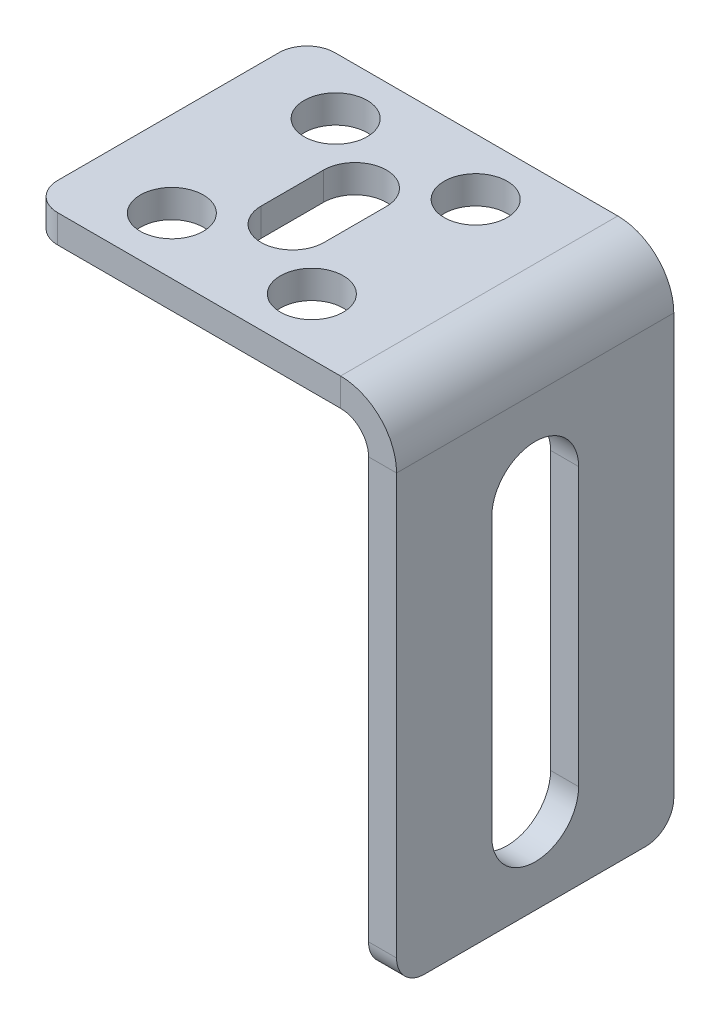
ISO-10303-21;
HEADER;
FILE_DESCRIPTION(('STEP AP214'),'2;1');
FILE_NAME('part.step','',(''),(''),'','','');
FILE_SCHEMA(('AUTOMOTIVE_DESIGN { 1 0 10303 214 1 1 1 1 }'));
ENDSEC;
DATA;
#1=APPLICATION_CONTEXT('core data for automotive mechanical design processes');
#2=APPLICATION_PROTOCOL_DEFINITION('international standard','automotive_design',2000,#1);
#3=PRODUCT_CONTEXT('',#1,'mechanical');
#4=PRODUCT('Part','Part','',(#3));
#5=PRODUCT_RELATED_PRODUCT_CATEGORY('part','',(#4));
#6=PRODUCT_DEFINITION_FORMATION('','',#4);
#7=PRODUCT_DEFINITION_CONTEXT('part definition',#1,'design');
#8=PRODUCT_DEFINITION('design','',#6,#7);
#9=PRODUCT_DEFINITION_SHAPE('','',#8);
#10=(LENGTH_UNIT() NAMED_UNIT(*) SI_UNIT(.MILLI.,.METRE.));
#11=(NAMED_UNIT(*) PLANE_ANGLE_UNIT() SI_UNIT($,.RADIAN.));
#12=(NAMED_UNIT(*) SI_UNIT($,.STERADIAN.) SOLID_ANGLE_UNIT());
#13=UNCERTAINTY_MEASURE_WITH_UNIT(LENGTH_MEASURE(1.E-05),#10,'distance_accuracy_value','');
#14=(GEOMETRIC_REPRESENTATION_CONTEXT(3) GLOBAL_UNCERTAINTY_ASSIGNED_CONTEXT((#13)) GLOBAL_UNIT_ASSIGNED_CONTEXT((#10,
#11,#12)) REPRESENTATION_CONTEXT('',''));
#15=CARTESIAN_POINT('',(0.,0.,0.));
#16=DIRECTION('',(0.,0.,1.));
#17=DIRECTION('',(1.,0.,0.));
#18=AXIS2_PLACEMENT_3D('',#15,#16,#17);
#19=CARTESIAN_POINT('',(-15.1,-36.001,12.1277472107018));
#20=DIRECTION('',(0.,1.,0.));
#21=DIRECTION('',(-1.,0.,0.));
#22=AXIS2_PLACEMENT_3D('',#19,#20,#21);
#23=CYLINDRICAL_SURFACE('',#22,2.25);
#24=CARTESIAN_POINT('',(-15.1,0.,12.1277472107018));
#25=DIRECTION('',(0.,1.,0.));
#26=DIRECTION('',(-1.,0.,0.));
#27=AXIS2_PLACEMENT_3D('',#24,#25,#26);
#28=CIRCLE('',#27,2.25);
#29=CARTESIAN_POINT('',(-17.35,0.,12.1277472107018));
#30=VERTEX_POINT('',#29);
#31=CARTESIAN_POINT('',(-12.85,0.,12.1277472107018));
#32=VERTEX_POINT('',#31);
#33=EDGE_CURVE('E165',#30,#32,#28,.T.);
#34=ORIENTED_EDGE('',*,*,#33,.T.);
#35=DIRECTION('',(0.,-1.,0.));
#36=VECTOR('',#35,1.);
#37=CARTESIAN_POINT('',(-12.85,0.,12.1277472107018));
#38=LINE('',#37,#36);
#39=CARTESIAN_POINT('',(-12.85,-2.,12.1277472107018));
#40=VERTEX_POINT('',#39);
#41=EDGE_CURVE('E621',#32,#40,#38,.T.);
#42=ORIENTED_EDGE('',*,*,#41,.T.);
#43=CARTESIAN_POINT('',(-15.1,-2.,12.1277472107018));
#44=DIRECTION('',(0.,-1.,0.));
#45=DIRECTION('',(1.,0.,0.));
#46=AXIS2_PLACEMENT_3D('',#43,#44,#45);
#47=CIRCLE('',#46,2.25);
#48=CARTESIAN_POINT('',(-17.35,-2.,12.1277472107018));
#49=VERTEX_POINT('',#48);
#50=EDGE_CURVE('E167',#49,#40,#47,.F.);
#51=ORIENTED_EDGE('',*,*,#50,.F.);
#52=DIRECTION('',(0.,-1.,0.));
#53=VECTOR('',#52,1.);
#54=CARTESIAN_POINT('',(-17.35,0.,12.1277472107018));
#55=LINE('',#54,#53);
#56=EDGE_CURVE('E153',#30,#49,#55,.T.);
#57=ORIENTED_EDGE('',*,*,#56,.F.);
#58=EDGE_LOOP('',(#34,#42,#51,#57));
#59=FACE_BOUND('',#58,.T.);
#60=ADVANCED_FACE('F16',(#59),#23,.F.);
#61=CARTESIAN_POINT('',(-15.1,-36.001,7.67225278929825));
#62=DIRECTION('',(0.,1.,0.));
#63=DIRECTION('',(-1.,0.,0.));
#64=AXIS2_PLACEMENT_3D('',#61,#62,#63);
#65=CYLINDRICAL_SURFACE('',#64,2.25);
#66=CARTESIAN_POINT('',(-15.1,-2.,7.67225278929825));
#67=DIRECTION('',(0.,-1.,0.));
#68=DIRECTION('',(1.,0.,0.));
#69=AXIS2_PLACEMENT_3D('',#66,#67,#68);
#70=CIRCLE('',#69,2.25);
#71=CARTESIAN_POINT('',(-17.35,-2.,7.67225278929824));
#72=VERTEX_POINT('',#71);
#73=CARTESIAN_POINT('',(-12.85,-2.,7.67225278929825));
#74=VERTEX_POINT('',#73);
#75=EDGE_CURVE('E629',#72,#74,#70,.T.);
#76=ORIENTED_EDGE('',*,*,#75,.T.);
#77=DIRECTION('',(0.,-1.,0.));
#78=VECTOR('',#77,1.);
#79=CARTESIAN_POINT('',(-12.85,0.,7.67225278929825));
#80=LINE('',#79,#78);
#81=CARTESIAN_POINT('',(-12.85,0.,7.67225278929825));
#82=VERTEX_POINT('',#81);
#83=EDGE_CURVE('E622',#82,#74,#80,.T.);
#84=ORIENTED_EDGE('',*,*,#83,.F.);
#85=CARTESIAN_POINT('',(-15.1,0.,7.67225278929825));
#86=DIRECTION('',(0.,-1.,0.));
#87=DIRECTION('',(-1.,0.,0.));
#88=AXIS2_PLACEMENT_3D('',#85,#86,#87);
#89=CIRCLE('',#88,2.25);
#90=CARTESIAN_POINT('',(-17.35,0.,7.67225278929824));
#91=VERTEX_POINT('',#90);
#92=EDGE_CURVE('E642',#91,#82,#89,.T.);
#93=ORIENTED_EDGE('',*,*,#92,.F.);
#94=DIRECTION('',(0.,-1.,0.));
#95=VECTOR('',#94,1.);
#96=CARTESIAN_POINT('',(-17.35,0.,7.67225278929824));
#97=LINE('',#96,#95);
#98=EDGE_CURVE('E154',#91,#72,#97,.T.);
#99=ORIENTED_EDGE('',*,*,#98,.T.);
#100=EDGE_LOOP('',(#76,#84,#93,#99));
#101=FACE_BOUND('',#100,.T.);
#102=ADVANCED_FACE('F352',(#101),#65,.F.);
#103=CARTESIAN_POINT('',(-2.,0.,0.));
#104=DIRECTION('',(0.,0.,1.));
#105=DIRECTION('',(0.,1.,0.));
#106=AXIS2_PLACEMENT_3D('',#103,#104,#105);
#107=PLANE('',#106);
#108=DIRECTION('',(0.,-1.,0.));
#109=VECTOR('',#108,1.);
#110=CARTESIAN_POINT('',(0.,0.,0.));
#111=LINE('',#110,#109);
#112=CARTESIAN_POINT('',(0.,-34.,0.));
#113=VERTEX_POINT('',#112);
#114=CARTESIAN_POINT('',(0.,-4.,0.));
#115=VERTEX_POINT('',#114);
#116=EDGE_CURVE('E237',#113,#115,#111,.F.);
#117=ORIENTED_EDGE('',*,*,#116,.F.);
#118=DIRECTION('',(1.,0.,0.));
#119=VECTOR('',#118,1.);
#120=CARTESIAN_POINT('',(-2.,-34.,0.));
#121=LINE('',#120,#119);
#122=CARTESIAN_POINT('',(-2.,-34.,0.));
#123=VERTEX_POINT('',#122);
#124=EDGE_CURVE('E251',#113,#123,#121,.F.);
#125=ORIENTED_EDGE('',*,*,#124,.T.);
#126=DIRECTION('',(0.,1.,0.));
#127=VECTOR('',#126,1.);
#128=CARTESIAN_POINT('',(-2.,0.,0.));
#129=LINE('',#128,#127);
#130=CARTESIAN_POINT('',(-2.,-4.,0.));
#131=VERTEX_POINT('',#130);
#132=EDGE_CURVE('E189',#123,#131,#129,.T.);
#133=ORIENTED_EDGE('',*,*,#132,.T.);
#134=DIRECTION('',(-1.,0.,0.));
#135=VECTOR('',#134,1.);
#136=CARTESIAN_POINT('',(-2.,-4.,0.));
#137=LINE('',#136,#135);
#138=EDGE_CURVE('E248',#115,#131,#137,.T.);
#139=ORIENTED_EDGE('',*,*,#138,.F.);
#140=EDGE_LOOP('',(#117,#125,#133,#139));
#141=FACE_BOUND('',#140,.T.);
#142=ADVANCED_FACE('F350',(#141),#107,.F.);
#143=CARTESIAN_POINT('',(-2.,-36.,64.3245999420545));
#144=DIRECTION('',(0.,1.,0.));
#145=DIRECTION('',(0.,0.,-1.));
#146=AXIS2_PLACEMENT_3D('',#143,#144,#145);
#147=PLANE('',#146);
#148=DIRECTION('',(0.,0.,-1.));
#149=VECTOR('',#148,1.);
#150=CARTESIAN_POINT('',(-2.,-36.,64.3245999420545));
#151=LINE('',#150,#149);
#152=CARTESIAN_POINT('',(-2.,-36.,17.8));
#153=VERTEX_POINT('',#152);
#154=CARTESIAN_POINT('',(-2.,-36.,2.));
#155=VERTEX_POINT('',#154);
#156=EDGE_CURVE('E192',#153,#155,#151,.T.);
#157=ORIENTED_EDGE('',*,*,#156,.T.);
#158=DIRECTION('',(1.,0.,0.));
#159=VECTOR('',#158,1.);
#160=CARTESIAN_POINT('',(-2.,-36.,2.));
#161=LINE('',#160,#159);
#162=CARTESIAN_POINT('',(0.,-36.,2.));
#163=VERTEX_POINT('',#162);
#164=EDGE_CURVE('E262',#155,#163,#161,.T.);
#165=ORIENTED_EDGE('',*,*,#164,.T.);
#166=DIRECTION('',(0.,0.,1.));
#167=VECTOR('',#166,1.);
#168=CARTESIAN_POINT('',(0.,-36.,64.3245999420545));
#169=LINE('',#168,#167);
#170=CARTESIAN_POINT('',(0.,-36.,17.8));
#171=VERTEX_POINT('',#170);
#172=EDGE_CURVE('E229',#171,#163,#169,.F.);
#173=ORIENTED_EDGE('',*,*,#172,.F.);
#174=DIRECTION('',(1.,0.,0.));
#175=VECTOR('',#174,1.);
#176=CARTESIAN_POINT('',(-2.,-36.,17.8));
#177=LINE('',#176,#175);
#178=EDGE_CURVE('E259',#171,#153,#177,.F.);
#179=ORIENTED_EDGE('',*,*,#178,.T.);
#180=EDGE_LOOP('',(#157,#165,#173,#179));
#181=FACE_BOUND('',#180,.T.);
#182=ADVANCED_FACE('F342',(#181),#147,.F.);
#183=CARTESIAN_POINT('',(-2.,0.,19.8));
#184=DIRECTION('',(0.,0.,-1.));
#185=DIRECTION('',(0.,-1.,0.));
#186=AXIS2_PLACEMENT_3D('',#183,#184,#185);
#187=PLANE('',#186);
#188=DIRECTION('',(0.,-1.,0.));
#189=VECTOR('',#188,1.);
#190=CARTESIAN_POINT('',(-2.,0.,19.8));
#191=LINE('',#190,#189);
#192=CARTESIAN_POINT('',(-2.,-4.,19.8));
#193=VERTEX_POINT('',#192);
#194=CARTESIAN_POINT('',(-2.,-34.,19.8));
#195=VERTEX_POINT('',#194);
#196=EDGE_CURVE('E186',#193,#195,#191,.T.);
#197=ORIENTED_EDGE('',*,*,#196,.T.);
#198=DIRECTION('',(1.,0.,0.));
#199=VECTOR('',#198,1.);
#200=CARTESIAN_POINT('',(-2.,-34.,19.8));
#201=LINE('',#200,#199);
#202=CARTESIAN_POINT('',(0.,-34.,19.8));
#203=VERTEX_POINT('',#202);
#204=EDGE_CURVE('E268',#195,#203,#201,.T.);
#205=ORIENTED_EDGE('',*,*,#204,.T.);
#206=DIRECTION('',(0.,-1.,0.));
#207=VECTOR('',#206,1.);
#208=CARTESIAN_POINT('',(0.,0.,19.8));
#209=LINE('',#208,#207);
#210=CARTESIAN_POINT('',(0.,-4.,19.8));
#211=VERTEX_POINT('',#210);
#212=EDGE_CURVE('E233',#211,#203,#209,.T.);
#213=ORIENTED_EDGE('',*,*,#212,.F.);
#214=DIRECTION('',(-1.,0.,0.));
#215=VECTOR('',#214,1.);
#216=CARTESIAN_POINT('',(-2.,-4.,19.8));
#217=LINE('',#216,#215);
#218=EDGE_CURVE('E246',#211,#193,#217,.T.);
#219=ORIENTED_EDGE('',*,*,#218,.T.);
#220=EDGE_LOOP('',(#197,#205,#213,#219));
#221=FACE_BOUND('',#220,.T.);
#222=ADVANCED_FACE('F333',(#221),#187,.F.);
#223=CARTESIAN_POINT('',(-4.,-4.,19.8));
#224=DIRECTION('',(0.,0.,1.));
#225=DIRECTION('',(1.,0.,0.));
#226=AXIS2_PLACEMENT_3D('',#223,#224,#225);
#227=PLANE('',#226);
#228=ORIENTED_EDGE('',*,*,#218,.F.);
#229=CARTESIAN_POINT('',(-4.,-4.,19.8));
#230=DIRECTION('',(0.,0.,1.));
#231=DIRECTION('',(1.,0.,0.));
#232=AXIS2_PLACEMENT_3D('',#229,#230,#231);
#233=CIRCLE('',#232,4.);
#234=CARTESIAN_POINT('',(-4.,0.,19.8));
#235=VERTEX_POINT('',#234);
#236=EDGE_CURVE('E230',#211,#235,#233,.T.);
#237=ORIENTED_EDGE('',*,*,#236,.T.);
#238=DIRECTION('',(0.,-1.,0.));
#239=VECTOR('',#238,1.);
#240=CARTESIAN_POINT('',(-4.,-2.,19.8));
#241=LINE('',#240,#239);
#242=CARTESIAN_POINT('',(-4.,-2.,19.8));
#243=VERTEX_POINT('',#242);
#244=EDGE_CURVE('E243',#235,#243,#241,.T.);
#245=ORIENTED_EDGE('',*,*,#244,.T.);
#246=CARTESIAN_POINT('',(-4.,-4.,19.8));
#247=DIRECTION('',(0.,0.,-1.));
#248=DIRECTION('',(-1.,0.,0.));
#249=AXIS2_PLACEMENT_3D('',#246,#247,#248);
#250=CIRCLE('',#249,2.);
#251=EDGE_CURVE('E190',#193,#243,#250,.F.);
#252=ORIENTED_EDGE('',*,*,#251,.F.);
#253=EDGE_LOOP('',(#228,#237,#245,#252));
#254=FACE_BOUND('',#253,.T.);
#255=ADVANCED_FACE('F326',(#254),#227,.T.);
#256=CARTESIAN_POINT('',(0.,-2.,19.8));
#257=DIRECTION('',(0.,0.,-1.));
#258=DIRECTION('',(1.,0.,0.));
#259=AXIS2_PLACEMENT_3D('',#256,#257,#258);
#260=PLANE('',#259);
#261=DIRECTION('',(1.,0.,0.));
#262=VECTOR('',#261,1.);
#263=CARTESIAN_POINT('',(0.,0.,19.8));
#264=LINE('',#263,#262);
#265=CARTESIAN_POINT('',(-24.2,0.,19.8));
#266=VERTEX_POINT('',#265);
#267=EDGE_CURVE('E227',#266,#235,#264,.T.);
#268=ORIENTED_EDGE('',*,*,#267,.F.);
#269=DIRECTION('',(0.,-1.,0.));
#270=VECTOR('',#269,1.);
#271=CARTESIAN_POINT('',(-24.2,-2.,19.8));
#272=LINE('',#271,#270);
#273=CARTESIAN_POINT('',(-24.2,-2.,19.8));
#274=VERTEX_POINT('',#273);
#275=EDGE_CURVE('E270',#266,#274,#272,.T.);
#276=ORIENTED_EDGE('',*,*,#275,.T.);
#277=DIRECTION('',(1.,0.,0.));
#278=VECTOR('',#277,1.);
#279=CARTESIAN_POINT('',(0.,-2.,19.8));
#280=LINE('',#279,#278);
#281=EDGE_CURVE('E195',#274,#243,#280,.T.);
#282=ORIENTED_EDGE('',*,*,#281,.T.);
#283=ORIENTED_EDGE('',*,*,#244,.F.);
#284=EDGE_LOOP('',(#268,#276,#282,#283));
#285=FACE_BOUND('',#284,.T.);
#286=ADVANCED_FACE('F293',(#285),#260,.F.);
#287=CARTESIAN_POINT('',(-26.2,-2.,64.3245999420545));
#288=DIRECTION('',(-1.,0.,0.));
#289=DIRECTION('',(0.,0.,-1.));
#290=AXIS2_PLACEMENT_3D('',#287,#288,#289);
#291=PLANE('',#290);
#292=DIRECTION('',(0.,0.,-1.));
#293=VECTOR('',#292,1.);
#294=CARTESIAN_POINT('',(-26.2,-2.,64.3245999420545));
#295=LINE('',#294,#293);
#296=CARTESIAN_POINT('',(-26.2,-2.,17.8));
#297=VERTEX_POINT('',#296);
#298=CARTESIAN_POINT('',(-26.2,-2.,2.));
#299=VERTEX_POINT('',#298);
#300=EDGE_CURVE('E197',#297,#299,#295,.T.);
#301=ORIENTED_EDGE('',*,*,#300,.F.);
#302=DIRECTION('',(0.,1.,0.));
#303=VECTOR('',#302,1.);
#304=CARTESIAN_POINT('',(-26.2,-2.,17.8));
#305=LINE('',#304,#303);
#306=CARTESIAN_POINT('',(-26.2,0.,17.8));
#307=VERTEX_POINT('',#306);
#308=EDGE_CURVE('E280',#297,#307,#305,.T.);
#309=ORIENTED_EDGE('',*,*,#308,.T.);
#310=DIRECTION('',(0.,0.,1.));
#311=VECTOR('',#310,1.);
#312=CARTESIAN_POINT('',(-26.2,0.,64.3245999420545));
#313=LINE('',#312,#311);
#314=CARTESIAN_POINT('',(-26.2,0.,2.));
#315=VERTEX_POINT('',#314);
#316=EDGE_CURVE('E224',#307,#315,#313,.F.);
#317=ORIENTED_EDGE('',*,*,#316,.T.);
#318=DIRECTION('',(0.,1.,0.));
#319=VECTOR('',#318,1.);
#320=CARTESIAN_POINT('',(-26.2,-2.,2.));
#321=LINE('',#320,#319);
#322=EDGE_CURVE('E277',#315,#299,#321,.F.);
#323=ORIENTED_EDGE('',*,*,#322,.T.);
#324=EDGE_LOOP('',(#301,#309,#317,#323));
#325=FACE_BOUND('',#324,.T.);
#326=ADVANCED_FACE('F300',(#325),#291,.T.);
#327=CARTESIAN_POINT('',(0.,-2.,0.));
#328=DIRECTION('',(0.,0.,1.));
#329=DIRECTION('',(-1.,0.,0.));
#330=AXIS2_PLACEMENT_3D('',#327,#328,#329);
#331=PLANE('',#330);
#332=DIRECTION('',(-1.,0.,0.));
#333=VECTOR('',#332,1.);
#334=CARTESIAN_POINT('',(0.,-2.,0.));
#335=LINE('',#334,#333);
#336=CARTESIAN_POINT('',(-4.,-2.,0.));
#337=VERTEX_POINT('',#336);
#338=CARTESIAN_POINT('',(-24.2,-2.,0.));
#339=VERTEX_POINT('',#338);
#340=EDGE_CURVE('E200',#337,#339,#335,.T.);
#341=ORIENTED_EDGE('',*,*,#340,.T.);
#342=DIRECTION('',(0.,-1.,0.));
#343=VECTOR('',#342,1.);
#344=CARTESIAN_POINT('',(-24.2,-2.,0.));
#345=LINE('',#344,#343);
#346=CARTESIAN_POINT('',(-24.2,0.,0.));
#347=VERTEX_POINT('',#346);
#348=EDGE_CURVE('E10',#339,#347,#345,.F.);
#349=ORIENTED_EDGE('',*,*,#348,.T.);
#350=DIRECTION('',(1.,0.,0.));
#351=VECTOR('',#350,1.);
#352=CARTESIAN_POINT('',(0.,0.,0.));
#353=LINE('',#352,#351);
#354=CARTESIAN_POINT('',(-4.,0.,0.));
#355=VERTEX_POINT('',#354);
#356=EDGE_CURVE('E221',#355,#347,#353,.F.);
#357=ORIENTED_EDGE('',*,*,#356,.F.);
#358=DIRECTION('',(0.,-1.,0.));
#359=VECTOR('',#358,1.);
#360=CARTESIAN_POINT('',(-4.,-2.,0.));
#361=LINE('',#360,#359);
#362=EDGE_CURVE('E209',#355,#337,#361,.T.);
#363=ORIENTED_EDGE('',*,*,#362,.T.);
#364=EDGE_LOOP('',(#341,#349,#357,#363));
#365=FACE_BOUND('',#364,.T.);
#366=ADVANCED_FACE('F308',(#365),#331,.F.);
#367=CARTESIAN_POINT('',(-4.,-4.,0.));
#368=DIRECTION('',(0.,0.,-1.));
#369=DIRECTION('',(-1.,0.,0.));
#370=AXIS2_PLACEMENT_3D('',#367,#368,#369);
#371=PLANE('',#370);
#372=CARTESIAN_POINT('',(-4.,-4.,0.));
#373=DIRECTION('',(0.,0.,1.));
#374=DIRECTION('',(1.,0.,0.));
#375=AXIS2_PLACEMENT_3D('',#372,#373,#374);
#376=CIRCLE('',#375,4.);
#377=EDGE_CURVE('E234',#355,#115,#376,.F.);
#378=ORIENTED_EDGE('',*,*,#377,.T.);
#379=ORIENTED_EDGE('',*,*,#138,.T.);
#380=CARTESIAN_POINT('',(-4.,-4.,0.));
#381=DIRECTION('',(0.,0.,1.));
#382=DIRECTION('',(1.,0.,0.));
#383=AXIS2_PLACEMENT_3D('',#380,#381,#382);
#384=CIRCLE('',#383,2.);
#385=EDGE_CURVE('E210',#337,#131,#384,.F.);
#386=ORIENTED_EDGE('',*,*,#385,.F.);
#387=ORIENTED_EDGE('',*,*,#362,.F.);
#388=EDGE_LOOP('',(#378,#379,#386,#387));
#389=FACE_BOUND('',#388,.T.);
#390=ADVANCED_FACE('F312',(#389),#371,.T.);
#391=CARTESIAN_POINT('',(0.,-2.,64.3245999420545));
#392=DIRECTION('',(0.,-1.,0.));
#393=DIRECTION('',(1.,0.,0.));
#394=AXIS2_PLACEMENT_3D('',#391,#392,#393);
#395=PLANE('',#394);
#396=DIRECTION('',(0.,0.,1.));
#397=VECTOR('',#396,1.);
#398=CARTESIAN_POINT('',(-12.85,-2.,12.1277472107018));
#399=LINE('',#398,#397);
#400=EDGE_CURVE('E159',#74,#40,#399,.T.);
#401=ORIENTED_EDGE('',*,*,#400,.F.);
#402=ORIENTED_EDGE('',*,*,#75,.F.);
#403=DIRECTION('',(0.,0.,-1.));
#404=VECTOR('',#403,1.);
#405=CARTESIAN_POINT('',(-17.35,-2.,12.1277472107018));
#406=LINE('',#405,#404);
#407=EDGE_CURVE('E31',#49,#72,#406,.T.);
#408=ORIENTED_EDGE('',*,*,#407,.F.);
#409=ORIENTED_EDGE('',*,*,#50,.T.);
#410=EDGE_LOOP('',(#401,#402,#408,#409));
#411=FACE_BOUND('',#410,.T.);
#412=CARTESIAN_POINT('',(-10.1,-2.,15.75));
#413=DIRECTION('',(0.,-1.,0.));
#414=DIRECTION('',(1.,0.,0.));
#415=AXIS2_PLACEMENT_3D('',#412,#413,#414);
#416=CIRCLE('',#415,2.25);
#417=CARTESIAN_POINT('',(-7.85,-2.,15.75));
#418=VERTEX_POINT('',#417);
#419=EDGE_CURVE('E638',#418,#418,#416,.T.);
#420=ORIENTED_EDGE('',*,*,#419,.F.);
#421=EDGE_LOOP('',(#420));
#422=FACE_BOUND('',#421,.T.);
#423=CARTESIAN_POINT('',(-20.1,-2.,15.75));
#424=DIRECTION('',(0.,-1.,0.));
#425=DIRECTION('',(1.,0.,0.));
#426=AXIS2_PLACEMENT_3D('',#423,#424,#425);
#427=CIRCLE('',#426,2.25);
#428=CARTESIAN_POINT('',(-17.85,-2.,15.75));
#429=VERTEX_POINT('',#428);
#430=EDGE_CURVE('E644',#429,#429,#427,.T.);
#431=ORIENTED_EDGE('',*,*,#430,.F.);
#432=EDGE_LOOP('',(#431));
#433=FACE_BOUND('',#432,.T.);
#434=CARTESIAN_POINT('',(-10.1,-2.,4.05000000000002));
#435=DIRECTION('',(0.,-1.,0.));
#436=DIRECTION('',(1.,0.,0.));
#437=AXIS2_PLACEMENT_3D('',#434,#435,#436);
#438=CIRCLE('',#437,2.25);
#439=CARTESIAN_POINT('',(-7.85,-2.,4.05000000000002));
#440=VERTEX_POINT('',#439);
#441=EDGE_CURVE('E171',#440,#440,#438,.F.);
#442=ORIENTED_EDGE('',*,*,#441,.T.);
#443=EDGE_LOOP('',(#442));
#444=FACE_BOUND('',#443,.T.);
#445=CARTESIAN_POINT('',(-20.1,-2.,4.05000000000002));
#446=DIRECTION('',(0.,-1.,0.));
#447=DIRECTION('',(1.,0.,0.));
#448=AXIS2_PLACEMENT_3D('',#445,#446,#447);
#449=CIRCLE('',#448,2.25);
#450=CARTESIAN_POINT('',(-17.85,-2.,4.05000000000002));
#451=VERTEX_POINT('',#450);
#452=EDGE_CURVE('E182',#451,#451,#449,.F.);
#453=ORIENTED_EDGE('',*,*,#452,.T.);
#454=EDGE_LOOP('',(#453));
#455=FACE_BOUND('',#454,.T.);
#456=ORIENTED_EDGE('',*,*,#281,.F.);
#457=CARTESIAN_POINT('',(-24.2,-2.,17.8));
#458=DIRECTION('',(0.,-1.,0.));
#459=DIRECTION('',(1.,0.,0.));
#460=AXIS2_PLACEMENT_3D('',#457,#458,#459);
#461=CIRCLE('',#460,2.);
#462=EDGE_CURVE('E275',#274,#297,#461,.T.);
#463=ORIENTED_EDGE('',*,*,#462,.T.);
#464=ORIENTED_EDGE('',*,*,#300,.T.);
#465=CARTESIAN_POINT('',(-24.2,-2.,2.));
#466=DIRECTION('',(0.,-1.,0.));
#467=DIRECTION('',(1.,0.,0.));
#468=AXIS2_PLACEMENT_3D('',#465,#466,#467);
#469=CIRCLE('',#468,2.);
#470=EDGE_CURVE('E273',#299,#339,#469,.T.);
#471=ORIENTED_EDGE('',*,*,#470,.T.);
#472=ORIENTED_EDGE('',*,*,#340,.F.);
#473=DIRECTION('',(0.,0.,-1.));
#474=VECTOR('',#473,1.);
#475=CARTESIAN_POINT('',(-4.,-2.,19.8));
#476=LINE('',#475,#474);
#477=EDGE_CURVE('E206',#337,#243,#476,.F.);
#478=ORIENTED_EDGE('',*,*,#477,.T.);
#479=EDGE_LOOP('',(#456,#463,#464,#471,#472,#478));
#480=FACE_BOUND('',#479,.T.);
#481=ADVANCED_FACE('F298',(#411,#422,#433,#444,#455,#480),#395,.T.);
#482=CARTESIAN_POINT('',(-2.,0.,64.3245999420545));
#483=DIRECTION('',(-1.,0.,0.));
#484=DIRECTION('',(0.,-1.,0.));
#485=AXIS2_PLACEMENT_3D('',#482,#483,#484);
#486=PLANE('',#485);
#487=CARTESIAN_POINT('',(-2.,-29.9,9.90000000000001));
#488=DIRECTION('',(-1.,0.,0.));
#489=DIRECTION('',(0.,-1.,0.));
#490=AXIS2_PLACEMENT_3D('',#487,#488,#489);
#491=CIRCLE('',#490,3.1);
#492=CARTESIAN_POINT('',(-2.,-29.9,6.80000000000001));
#493=VERTEX_POINT('',#492);
#494=CARTESIAN_POINT('',(-2.,-29.9,13.));
#495=VERTEX_POINT('',#494);
#496=EDGE_CURVE('E657',#493,#495,#491,.T.);
#497=ORIENTED_EDGE('',*,*,#496,.F.);
#498=DIRECTION('',(0.,-1.,0.));
#499=VECTOR('',#498,1.);
#500=CARTESIAN_POINT('',(-2.,-29.9,6.80000000000001));
#501=LINE('',#500,#499);
#502=CARTESIAN_POINT('',(-2.,-10.1,6.80000000000001));
#503=VERTEX_POINT('',#502);
#504=EDGE_CURVE('E665',#503,#493,#501,.T.);
#505=ORIENTED_EDGE('',*,*,#504,.F.);
#506=CARTESIAN_POINT('',(-2.,-10.1,9.90000000000001));
#507=DIRECTION('',(-1.,0.,0.));
#508=DIRECTION('',(0.,-1.,0.));
#509=AXIS2_PLACEMENT_3D('',#506,#507,#508);
#510=CIRCLE('',#509,3.1);
#511=CARTESIAN_POINT('',(-2.,-10.1,13.));
#512=VERTEX_POINT('',#511);
#513=EDGE_CURVE('E662',#512,#503,#510,.T.);
#514=ORIENTED_EDGE('',*,*,#513,.F.);
#515=DIRECTION('',(0.,1.,0.));
#516=VECTOR('',#515,1.);
#517=CARTESIAN_POINT('',(-2.,-29.9,13.));
#518=LINE('',#517,#516);
#519=EDGE_CURVE('E659',#495,#512,#518,.T.);
#520=ORIENTED_EDGE('',*,*,#519,.F.);
#521=EDGE_LOOP('',(#497,#505,#514,#520));
#522=FACE_BOUND('',#521,.T.);
#523=ORIENTED_EDGE('',*,*,#132,.F.);
#524=CARTESIAN_POINT('',(-2.,-34.,2.));
#525=DIRECTION('',(-1.,0.,0.));
#526=DIRECTION('',(0.,-1.,0.));
#527=AXIS2_PLACEMENT_3D('',#524,#525,#526);
#528=CIRCLE('',#527,2.);
#529=EDGE_CURVE('E257',#123,#155,#528,.T.);
#530=ORIENTED_EDGE('',*,*,#529,.T.);
#531=ORIENTED_EDGE('',*,*,#156,.F.);
#532=CARTESIAN_POINT('',(-2.,-34.,17.8));
#533=DIRECTION('',(-1.,0.,0.));
#534=DIRECTION('',(0.,-1.,0.));
#535=AXIS2_PLACEMENT_3D('',#532,#533,#534);
#536=CIRCLE('',#535,2.);
#537=EDGE_CURVE('E255',#153,#195,#536,.T.);
#538=ORIENTED_EDGE('',*,*,#537,.T.);
#539=ORIENTED_EDGE('',*,*,#196,.F.);
#540=DIRECTION('',(0.,0.,-1.));
#541=VECTOR('',#540,1.);
#542=CARTESIAN_POINT('',(-2.,-4.,0.));
#543=LINE('',#542,#541);
#544=EDGE_CURVE('E203',#193,#131,#543,.T.);
#545=ORIENTED_EDGE('',*,*,#544,.T.);
#546=EDGE_LOOP('',(#523,#530,#531,#538,#539,#545));
#547=FACE_BOUND('',#546,.T.);
#548=ADVANCED_FACE('F320',(#522,#547),#486,.T.);
#549=CARTESIAN_POINT('',(-4.,-4.,64.3245999420545));
#550=DIRECTION('',(0.,0.,1.));
#551=DIRECTION('',(1.,0.,0.));
#552=AXIS2_PLACEMENT_3D('',#549,#550,#551);
#553=CYLINDRICAL_SURFACE('',#552,2.);
#554=ORIENTED_EDGE('',*,*,#251,.T.);
#555=ORIENTED_EDGE('',*,*,#477,.F.);
#556=ORIENTED_EDGE('',*,*,#385,.T.);
#557=ORIENTED_EDGE('',*,*,#544,.F.);
#558=EDGE_LOOP('',(#554,#555,#556,#557));
#559=FACE_BOUND('',#558,.T.);
#560=ADVANCED_FACE('F316',(#559),#553,.F.);
#561=CARTESIAN_POINT('',(0.,0.,64.3245999420545));
#562=DIRECTION('',(0.,-1.,0.));
#563=DIRECTION('',(1.,0.,0.));
#564=AXIS2_PLACEMENT_3D('',#561,#562,#563);
#565=PLANE('',#564);
#566=CARTESIAN_POINT('',(-10.1,0.,15.75));
#567=DIRECTION('',(0.,-1.,0.));
#568=DIRECTION('',(-1.,0.,0.));
#569=AXIS2_PLACEMENT_3D('',#566,#567,#568);
#570=CIRCLE('',#569,2.25);
#571=CARTESIAN_POINT('',(-12.35,0.,15.75));
#572=VERTEX_POINT('',#571);
#573=EDGE_CURVE('E635',#572,#572,#570,.T.);
#574=ORIENTED_EDGE('',*,*,#573,.T.);
#575=EDGE_LOOP('',(#574));
#576=FACE_BOUND('',#575,.T.);
#577=ORIENTED_EDGE('',*,*,#92,.T.);
#578=DIRECTION('',(0.,0.,1.));
#579=VECTOR('',#578,1.);
#580=CARTESIAN_POINT('',(-12.85,0.,12.1277472107018));
#581=LINE('',#580,#579);
#582=EDGE_CURVE('E39',#82,#32,#581,.T.);
#583=ORIENTED_EDGE('',*,*,#582,.T.);
#584=ORIENTED_EDGE('',*,*,#33,.F.);
#585=DIRECTION('',(0.,0.,-1.));
#586=VECTOR('',#585,1.);
#587=CARTESIAN_POINT('',(-17.35,0.,12.1277472107018));
#588=LINE('',#587,#586);
#589=EDGE_CURVE('E150',#30,#91,#588,.T.);
#590=ORIENTED_EDGE('',*,*,#589,.T.);
#591=EDGE_LOOP('',(#577,#583,#584,#590));
#592=FACE_BOUND('',#591,.T.);
#593=CARTESIAN_POINT('',(-20.1,0.,15.75));
#594=DIRECTION('',(0.,-1.,0.));
#595=DIRECTION('',(-1.,0.,0.));
#596=AXIS2_PLACEMENT_3D('',#593,#594,#595);
#597=CIRCLE('',#596,2.25);
#598=CARTESIAN_POINT('',(-22.35,0.,15.75));
#599=VERTEX_POINT('',#598);
#600=EDGE_CURVE('E626',#599,#599,#597,.T.);
#601=ORIENTED_EDGE('',*,*,#600,.T.);
#602=EDGE_LOOP('',(#601));
#603=FACE_BOUND('',#602,.T.);
#604=CARTESIAN_POINT('',(-10.1,0.,4.05000000000002));
#605=DIRECTION('',(0.,1.,0.));
#606=DIRECTION('',(-1.,0.,0.));
#607=AXIS2_PLACEMENT_3D('',#604,#605,#606);
#608=CIRCLE('',#607,2.25);
#609=CARTESIAN_POINT('',(-12.35,0.,4.05000000000002));
#610=VERTEX_POINT('',#609);
#611=EDGE_CURVE('E174',#610,#610,#608,.T.);
#612=ORIENTED_EDGE('',*,*,#611,.F.);
#613=EDGE_LOOP('',(#612));
#614=FACE_BOUND('',#613,.T.);
#615=CARTESIAN_POINT('',(-20.1,0.,4.05000000000002));
#616=DIRECTION('',(0.,1.,0.));
#617=DIRECTION('',(-1.,0.,0.));
#618=AXIS2_PLACEMENT_3D('',#615,#616,#617);
#619=CIRCLE('',#618,2.25);
#620=CARTESIAN_POINT('',(-22.35,0.,4.05000000000002));
#621=VERTEX_POINT('',#620);
#622=EDGE_CURVE('E176',#621,#621,#619,.T.);
#623=ORIENTED_EDGE('',*,*,#622,.F.);
#624=EDGE_LOOP('',(#623));
#625=FACE_BOUND('',#624,.T.);
#626=ORIENTED_EDGE('',*,*,#316,.F.);
#627=CARTESIAN_POINT('',(-24.2,0.,17.8));
#628=DIRECTION('',(0.,-1.,0.));
#629=DIRECTION('',(1.,0.,0.));
#630=AXIS2_PLACEMENT_3D('',#627,#628,#629);
#631=CIRCLE('',#630,2.);
#632=EDGE_CURVE('E24',#307,#266,#631,.F.);
#633=ORIENTED_EDGE('',*,*,#632,.T.);
#634=ORIENTED_EDGE('',*,*,#267,.T.);
#635=DIRECTION('',(0.,0.,1.));
#636=VECTOR('',#635,1.);
#637=CARTESIAN_POINT('',(-4.,0.,64.3245999420545));
#638=LINE('',#637,#636);
#639=EDGE_CURVE('E213',#355,#235,#638,.T.);
#640=ORIENTED_EDGE('',*,*,#639,.F.);
#641=ORIENTED_EDGE('',*,*,#356,.T.);
#642=CARTESIAN_POINT('',(-24.2,0.,2.));
#643=DIRECTION('',(0.,-1.,0.));
#644=DIRECTION('',(1.,0.,0.));
#645=AXIS2_PLACEMENT_3D('',#642,#643,#644);
#646=CIRCLE('',#645,2.);
#647=EDGE_CURVE('E282',#347,#315,#646,.F.);
#648=ORIENTED_EDGE('',*,*,#647,.T.);
#649=EDGE_LOOP('',(#626,#633,#634,#640,#641,#648));
#650=FACE_BOUND('',#649,.T.);
#651=ADVANCED_FACE('F169',(#576,#592,#603,#614,#625,#650),#565,.F.);
#652=CARTESIAN_POINT('',(0.,0.,64.3245999420545));
#653=DIRECTION('',(-1.,0.,0.));
#654=DIRECTION('',(0.,-1.,0.));
#655=AXIS2_PLACEMENT_3D('',#652,#653,#654);
#656=PLANE('',#655);
#657=DIRECTION('',(0.,1.,0.));
#658=VECTOR('',#657,1.);
#659=CARTESIAN_POINT('',(0.,-29.9,6.80000000000001));
#660=LINE('',#659,#658);
#661=CARTESIAN_POINT('',(0.,-29.9,6.80000000000001));
#662=VERTEX_POINT('',#661);
#663=CARTESIAN_POINT('',(0.,-10.1,6.80000000000001));
#664=VERTEX_POINT('',#663);
#665=EDGE_CURVE('E651',#662,#664,#660,.T.);
#666=ORIENTED_EDGE('',*,*,#665,.F.);
#667=CARTESIAN_POINT('',(0.,-29.9,9.90000000000001));
#668=DIRECTION('',(-1.,0.,0.));
#669=DIRECTION('',(0.,-1.,0.));
#670=AXIS2_PLACEMENT_3D('',#667,#668,#669);
#671=CIRCLE('',#670,3.1);
#672=CARTESIAN_POINT('',(0.,-29.9,13.));
#673=VERTEX_POINT('',#672);
#674=EDGE_CURVE('E654',#673,#662,#671,.F.);
#675=ORIENTED_EDGE('',*,*,#674,.F.);
#676=DIRECTION('',(0.,-1.,0.));
#677=VECTOR('',#676,1.);
#678=CARTESIAN_POINT('',(0.,-29.9,13.));
#679=LINE('',#678,#677);
#680=CARTESIAN_POINT('',(0.,-10.1,13.));
#681=VERTEX_POINT('',#680);
#682=EDGE_CURVE('E185',#681,#673,#679,.T.);
#683=ORIENTED_EDGE('',*,*,#682,.F.);
#684=CARTESIAN_POINT('',(0.,-10.1,9.90000000000001));
#685=DIRECTION('',(-1.,0.,0.));
#686=DIRECTION('',(0.,-1.,0.));
#687=AXIS2_PLACEMENT_3D('',#684,#685,#686);
#688=CIRCLE('',#687,3.1);
#689=EDGE_CURVE('E641',#664,#681,#688,.F.);
#690=ORIENTED_EDGE('',*,*,#689,.F.);
#691=EDGE_LOOP('',(#666,#675,#683,#690));
#692=FACE_BOUND('',#691,.T.);
#693=ORIENTED_EDGE('',*,*,#172,.T.);
#694=CARTESIAN_POINT('',(0.,-34.,2.));
#695=DIRECTION('',(-1.,0.,0.));
#696=DIRECTION('',(0.,-1.,0.));
#697=AXIS2_PLACEMENT_3D('',#694,#695,#696);
#698=CIRCLE('',#697,2.);
#699=EDGE_CURVE('E266',#163,#113,#698,.F.);
#700=ORIENTED_EDGE('',*,*,#699,.T.);
#701=ORIENTED_EDGE('',*,*,#116,.T.);
#702=DIRECTION('',(0.,0.,1.));
#703=VECTOR('',#702,1.);
#704=CARTESIAN_POINT('',(0.,-4.,64.3245999420545));
#705=LINE('',#704,#703);
#706=EDGE_CURVE('E218',#211,#115,#705,.F.);
#707=ORIENTED_EDGE('',*,*,#706,.F.);
#708=ORIENTED_EDGE('',*,*,#212,.T.);
#709=CARTESIAN_POINT('',(0.,-34.,17.8));
#710=DIRECTION('',(-1.,0.,0.));
#711=DIRECTION('',(0.,-1.,0.));
#712=AXIS2_PLACEMENT_3D('',#709,#710,#711);
#713=CIRCLE('',#712,2.);
#714=EDGE_CURVE('E264',#203,#171,#713,.F.);
#715=ORIENTED_EDGE('',*,*,#714,.T.);
#716=EDGE_LOOP('',(#693,#700,#701,#707,#708,#715));
#717=FACE_BOUND('',#716,.T.);
#718=ADVANCED_FACE('F336',(#692,#717),#656,.F.);
#719=CARTESIAN_POINT('',(-4.,-4.,64.3245999420545));
#720=DIRECTION('',(0.,0.,1.));
#721=DIRECTION('',(1.,0.,0.));
#722=AXIS2_PLACEMENT_3D('',#719,#720,#721);
#723=CYLINDRICAL_SURFACE('',#722,4.);
#724=ORIENTED_EDGE('',*,*,#236,.F.);
#725=ORIENTED_EDGE('',*,*,#706,.T.);
#726=ORIENTED_EDGE('',*,*,#377,.F.);
#727=ORIENTED_EDGE('',*,*,#639,.T.);
#728=EDGE_LOOP('',(#724,#725,#726,#727));
#729=FACE_BOUND('',#728,.T.);
#730=ADVANCED_FACE('F331',(#729),#723,.T.);
#731=CARTESIAN_POINT('',(-2.,-34.,2.));
#732=DIRECTION('',(-1.,0.,0.));
#733=DIRECTION('',(0.,-1.,0.));
#734=AXIS2_PLACEMENT_3D('',#731,#732,#733);
#735=CYLINDRICAL_SURFACE('',#734,2.);
#736=ORIENTED_EDGE('',*,*,#699,.F.);
#737=ORIENTED_EDGE('',*,*,#164,.F.);
#738=ORIENTED_EDGE('',*,*,#529,.F.);
#739=ORIENTED_EDGE('',*,*,#124,.F.);
#740=EDGE_LOOP('',(#736,#737,#738,#739));
#741=FACE_BOUND('',#740,.T.);
#742=ADVANCED_FACE('F347',(#741),#735,.T.);
#743=CARTESIAN_POINT('',(-2.,-34.,17.8));
#744=DIRECTION('',(-1.,0.,0.));
#745=DIRECTION('',(0.,-1.,0.));
#746=AXIS2_PLACEMENT_3D('',#743,#744,#745);
#747=CYLINDRICAL_SURFACE('',#746,2.);
#748=ORIENTED_EDGE('',*,*,#714,.F.);
#749=ORIENTED_EDGE('',*,*,#204,.F.);
#750=ORIENTED_EDGE('',*,*,#537,.F.);
#751=ORIENTED_EDGE('',*,*,#178,.F.);
#752=EDGE_LOOP('',(#748,#749,#750,#751));
#753=FACE_BOUND('',#752,.T.);
#754=ADVANCED_FACE('F340',(#753),#747,.T.);
#755=CARTESIAN_POINT('',(-24.2,-2.,17.8));
#756=DIRECTION('',(0.,1.,0.));
#757=DIRECTION('',(-1.,0.,0.));
#758=AXIS2_PLACEMENT_3D('',#755,#756,#757);
#759=CYLINDRICAL_SURFACE('',#758,2.);
#760=ORIENTED_EDGE('',*,*,#632,.F.);
#761=ORIENTED_EDGE('',*,*,#308,.F.);
#762=ORIENTED_EDGE('',*,*,#462,.F.);
#763=ORIENTED_EDGE('',*,*,#275,.F.);
#764=EDGE_LOOP('',(#760,#761,#762,#763));
#765=FACE_BOUND('',#764,.T.);
#766=ADVANCED_FACE('F295',(#765),#759,.T.);
#767=CARTESIAN_POINT('',(-24.2,-2.,2.));
#768=DIRECTION('',(0.,1.,0.));
#769=DIRECTION('',(-1.,0.,0.));
#770=AXIS2_PLACEMENT_3D('',#767,#768,#769);
#771=CYLINDRICAL_SURFACE('',#770,2.);
#772=ORIENTED_EDGE('',*,*,#647,.F.);
#773=ORIENTED_EDGE('',*,*,#348,.F.);
#774=ORIENTED_EDGE('',*,*,#470,.F.);
#775=ORIENTED_EDGE('',*,*,#322,.F.);
#776=EDGE_LOOP('',(#772,#773,#774,#775));
#777=FACE_BOUND('',#776,.T.);
#778=ADVANCED_FACE('F18',(#777),#771,.T.);
#779=CARTESIAN_POINT('',(-20.1,-36.001,4.05000000000002));
#780=DIRECTION('',(0.,1.,0.));
#781=DIRECTION('',(-1.,0.,0.));
#782=AXIS2_PLACEMENT_3D('',#779,#780,#781);
#783=CYLINDRICAL_SURFACE('',#782,2.25);
#784=ORIENTED_EDGE('',*,*,#452,.F.);
#785=EDGE_LOOP('',(#784));
#786=FACE_BOUND('',#785,.T.);
#787=ORIENTED_EDGE('',*,*,#622,.T.);
#788=EDGE_LOOP('',(#787));
#789=FACE_BOUND('',#788,.T.);
#790=ADVANCED_FACE('F371',(#786,#789),#783,.F.);
#791=CARTESIAN_POINT('',(-10.1,-36.001,4.05000000000002));
#792=DIRECTION('',(0.,1.,0.));
#793=DIRECTION('',(-1.,0.,0.));
#794=AXIS2_PLACEMENT_3D('',#791,#792,#793);
#795=CYLINDRICAL_SURFACE('',#794,2.25);
#796=ORIENTED_EDGE('',*,*,#441,.F.);
#797=EDGE_LOOP('',(#796));
#798=FACE_BOUND('',#797,.T.);
#799=ORIENTED_EDGE('',*,*,#611,.T.);
#800=EDGE_LOOP('',(#799));
#801=FACE_BOUND('',#800,.T.);
#802=ADVANCED_FACE('F369',(#798,#801),#795,.F.);
#803=CARTESIAN_POINT('',(0.00100000000000794,-29.9,9.90000000000001));
#804=DIRECTION('',(-1.,0.,0.));
#805=DIRECTION('',(0.,-1.,0.));
#806=AXIS2_PLACEMENT_3D('',#803,#804,#805);
#807=CYLINDRICAL_SURFACE('',#806,3.1);
#808=ORIENTED_EDGE('',*,*,#674,.T.);
#809=DIRECTION('',(-1.,0.,0.));
#810=VECTOR('',#809,1.);
#811=CARTESIAN_POINT('',(0.00100000000000794,-29.9,6.80000000000001));
#812=LINE('',#811,#810);
#813=EDGE_CURVE('E669',#662,#493,#812,.T.);
#814=ORIENTED_EDGE('',*,*,#813,.T.);
#815=ORIENTED_EDGE('',*,*,#496,.T.);
#816=DIRECTION('',(-1.,0.,0.));
#817=VECTOR('',#816,1.);
#818=CARTESIAN_POINT('',(0.00100000000000794,-29.9,13.));
#819=LINE('',#818,#817);
#820=EDGE_CURVE('E668',#673,#495,#819,.T.);
#821=ORIENTED_EDGE('',*,*,#820,.F.);
#822=EDGE_LOOP('',(#808,#814,#815,#821));
#823=FACE_BOUND('',#822,.T.);
#824=ADVANCED_FACE('F500',(#823),#807,.F.);
#825=CARTESIAN_POINT('',(0.00100000000000794,-29.9,6.80000000000001));
#826=DIRECTION('',(0.,0.,-1.));
#827=DIRECTION('',(-1.,0.,0.));
#828=AXIS2_PLACEMENT_3D('',#825,#826,#827);
#829=PLANE('',#828);
#830=ORIENTED_EDGE('',*,*,#665,.T.);
#831=DIRECTION('',(-1.,0.,0.));
#832=VECTOR('',#831,1.);
#833=CARTESIAN_POINT('',(0.00100000000000577,-10.1,6.80000000000001));
#834=LINE('',#833,#832);
#835=EDGE_CURVE('E671',#664,#503,#834,.T.);
#836=ORIENTED_EDGE('',*,*,#835,.T.);
#837=ORIENTED_EDGE('',*,*,#504,.T.);
#838=ORIENTED_EDGE('',*,*,#813,.F.);
#839=EDGE_LOOP('',(#830,#836,#837,#838));
#840=FACE_BOUND('',#839,.T.);
#841=ADVANCED_FACE('F508',(#840),#829,.F.);
#842=CARTESIAN_POINT('',(0.00100000000000577,-10.1,9.90000000000001));
#843=DIRECTION('',(-1.,0.,0.));
#844=DIRECTION('',(0.,-1.,0.));
#845=AXIS2_PLACEMENT_3D('',#842,#843,#844);
#846=CYLINDRICAL_SURFACE('',#845,3.1);
#847=ORIENTED_EDGE('',*,*,#689,.T.);
#848=DIRECTION('',(-1.,0.,0.));
#849=VECTOR('',#848,1.);
#850=CARTESIAN_POINT('',(0.00100000000000577,-10.1,13.));
#851=LINE('',#850,#849);
#852=EDGE_CURVE('E673',#681,#512,#851,.T.);
#853=ORIENTED_EDGE('',*,*,#852,.T.);
#854=ORIENTED_EDGE('',*,*,#513,.T.);
#855=ORIENTED_EDGE('',*,*,#835,.F.);
#856=EDGE_LOOP('',(#847,#853,#854,#855));
#857=FACE_BOUND('',#856,.T.);
#858=ADVANCED_FACE('F516',(#857),#846,.F.);
#859=CARTESIAN_POINT('',(0.00100000000000794,-29.9,13.));
#860=DIRECTION('',(0.,0.,1.));
#861=DIRECTION('',(1.,0.,0.));
#862=AXIS2_PLACEMENT_3D('',#859,#860,#861);
#863=PLANE('',#862);
#864=ORIENTED_EDGE('',*,*,#682,.T.);
#865=ORIENTED_EDGE('',*,*,#820,.T.);
#866=ORIENTED_EDGE('',*,*,#519,.T.);
#867=ORIENTED_EDGE('',*,*,#852,.F.);
#868=EDGE_LOOP('',(#864,#865,#866,#867));
#869=FACE_BOUND('',#868,.T.);
#870=ADVANCED_FACE('F525',(#869),#863,.F.);
#871=CARTESIAN_POINT('',(-20.1,-36.001,15.75));
#872=DIRECTION('',(0.,1.,0.));
#873=DIRECTION('',(-1.,0.,0.));
#874=AXIS2_PLACEMENT_3D('',#871,#872,#873);
#875=CYLINDRICAL_SURFACE('',#874,2.25);
#876=ORIENTED_EDGE('',*,*,#430,.T.);
#877=EDGE_LOOP('',(#876));
#878=FACE_BOUND('',#877,.T.);
#879=ORIENTED_EDGE('',*,*,#600,.F.);
#880=EDGE_LOOP('',(#879));
#881=FACE_BOUND('',#880,.T.);
#882=ADVANCED_FACE('F534',(#878,#881),#875,.F.);
#883=CARTESIAN_POINT('',(-10.1,-36.001,15.75));
#884=DIRECTION('',(0.,1.,0.));
#885=DIRECTION('',(-1.,0.,0.));
#886=AXIS2_PLACEMENT_3D('',#883,#884,#885);
#887=CYLINDRICAL_SURFACE('',#886,2.25);
#888=ORIENTED_EDGE('',*,*,#419,.T.);
#889=EDGE_LOOP('',(#888));
#890=FACE_BOUND('',#889,.T.);
#891=ORIENTED_EDGE('',*,*,#573,.F.);
#892=EDGE_LOOP('',(#891));
#893=FACE_BOUND('',#892,.T.);
#894=ADVANCED_FACE('F543',(#890,#893),#887,.F.);
#895=CARTESIAN_POINT('',(-17.35,0.,12.1277472107018));
#896=DIRECTION('',(-1.,0.,0.));
#897=DIRECTION('',(0.,0.,1.));
#898=AXIS2_PLACEMENT_3D('',#895,#896,#897);
#899=PLANE('',#898);
#900=ORIENTED_EDGE('',*,*,#407,.T.);
#901=ORIENTED_EDGE('',*,*,#98,.F.);
#902=ORIENTED_EDGE('',*,*,#589,.F.);
#903=ORIENTED_EDGE('',*,*,#56,.T.);
#904=EDGE_LOOP('',(#900,#901,#902,#903));
#905=FACE_BOUND('',#904,.T.);
#906=ADVANCED_FACE('F152',(#905),#899,.F.);
#907=CARTESIAN_POINT('',(-12.85,0.,12.1277472107018));
#908=DIRECTION('',(1.,0.,0.));
#909=DIRECTION('',(0.,1.,0.));
#910=AXIS2_PLACEMENT_3D('',#907,#908,#909);
#911=PLANE('',#910);
#912=ORIENTED_EDGE('',*,*,#400,.T.);
#913=ORIENTED_EDGE('',*,*,#41,.F.);
#914=ORIENTED_EDGE('',*,*,#582,.F.);
#915=ORIENTED_EDGE('',*,*,#83,.T.);
#916=EDGE_LOOP('',(#912,#913,#914,#915));
#917=FACE_BOUND('',#916,.T.);
#918=ADVANCED_FACE('F560',(#917),#911,.F.);
#919=CLOSED_SHELL('',(#60,#102,#142,#182,#222,#255,#286,#326,#366,#390,#481,#548,#560,#651,#718,
#730,#742,#754,#766,#778,#790,#802,#824,#841,#858,#870,#882,#894,#906,#918));
#920=MANIFOLD_SOLID_BREP('B1',#919);
#921=ADVANCED_BREP_SHAPE_REPRESENTATION('',(#18,#920),#14);
#922=SHAPE_DEFINITION_REPRESENTATION(#9,#921);
ENDSEC;
END-ISO-10303-21;
